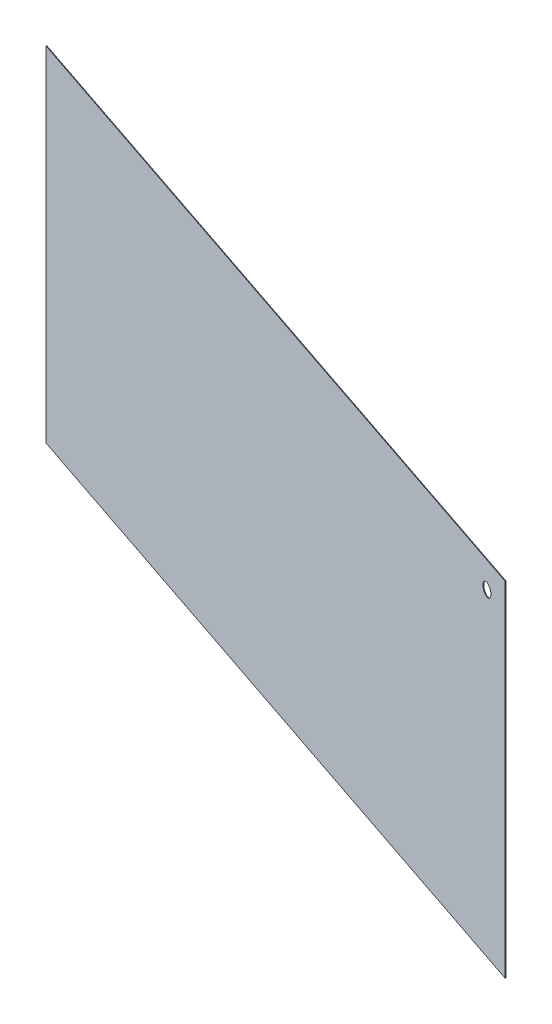
ISO-10303-21;
HEADER;
FILE_DESCRIPTION(('STEP AP214'),'2;1');
FILE_NAME('part.step','',(''),(''),'','','');
FILE_SCHEMA(('AUTOMOTIVE_DESIGN { 1 0 10303 214 1 1 1 1 }'));
ENDSEC;
DATA;
#1=APPLICATION_CONTEXT('core data for automotive mechanical design processes');
#2=APPLICATION_PROTOCOL_DEFINITION('international standard','automotive_design',2000,#1);
#3=PRODUCT_CONTEXT('',#1,'mechanical');
#4=PRODUCT('Part','Part','',(#3));
#5=PRODUCT_RELATED_PRODUCT_CATEGORY('part','',(#4));
#6=PRODUCT_DEFINITION_FORMATION('','',#4);
#7=PRODUCT_DEFINITION_CONTEXT('part definition',#1,'design');
#8=PRODUCT_DEFINITION('design','',#6,#7);
#9=PRODUCT_DEFINITION_SHAPE('','',#8);
#10=(LENGTH_UNIT() NAMED_UNIT(*) SI_UNIT(.MILLI.,.METRE.));
#11=(NAMED_UNIT(*) PLANE_ANGLE_UNIT() SI_UNIT($,.RADIAN.));
#12=(NAMED_UNIT(*) SI_UNIT($,.STERADIAN.) SOLID_ANGLE_UNIT());
#13=UNCERTAINTY_MEASURE_WITH_UNIT(LENGTH_MEASURE(1.E-05),#10,'distance_accuracy_value','');
#14=(GEOMETRIC_REPRESENTATION_CONTEXT(3) GLOBAL_UNCERTAINTY_ASSIGNED_CONTEXT((#13)) GLOBAL_UNIT_ASSIGNED_CONTEXT((#10,
#11,#12)) REPRESENTATION_CONTEXT('',''));
#15=CARTESIAN_POINT('',(0.,0.,0.));
#16=DIRECTION('',(0.,0.,1.));
#17=DIRECTION('',(1.,0.,0.));
#18=AXIS2_PLACEMENT_3D('',#15,#16,#17);
#19=CARTESIAN_POINT('',(-263.180218446603,546.5,779.785337524628));
#20=DIRECTION('',(-0.947491297113765,0.,-0.319781553398059));
#21=DIRECTION('',(0.,1.,0.));
#22=AXIS2_PLACEMENT_3D('',#19,#20,#21);
#23=PLANE('',#22);
#24=DIRECTION('',(0.319781553398059,0.,-0.947491297113765));
#25=VECTOR('',#24,1.);
#26=CARTESIAN_POINT('',(-263.180218446603,1093.,779.785337524628));
#27=LINE('',#26,#25);
#28=CARTESIAN_POINT('',(-263.500000000001,1093.,780.732828821742));
#29=VERTEX_POINT('',#28);
#30=CARTESIAN_POINT('',(-262.860436893205,1093.,778.837846227515));
#31=VERTEX_POINT('',#30);
#32=EDGE_CURVE('E11',#29,#31,#27,.T.);
#33=ORIENTED_EDGE('',*,*,#32,.F.);
#34=DIRECTION('',(0.,1.,0.));
#35=VECTOR('',#34,1.);
#36=CARTESIAN_POINT('',(-263.500000000001,546.5,780.732828821742));
#37=LINE('',#36,#35);
#38=CARTESIAN_POINT('',(-263.500000000001,0.,780.732828821742));
#39=VERTEX_POINT('',#38);
#40=EDGE_CURVE('E75',#29,#39,#37,.F.);
#41=ORIENTED_EDGE('',*,*,#40,.T.);
#42=DIRECTION('',(0.319781553398059,0.,-0.947491297113765));
#43=VECTOR('',#42,1.);
#44=CARTESIAN_POINT('',(-263.180218446603,0.,779.785337524628));
#45=LINE('',#44,#43);
#46=CARTESIAN_POINT('',(-262.860436893205,0.,778.837846227515));
#47=VERTEX_POINT('',#46);
#48=EDGE_CURVE('E47',#39,#47,#45,.T.);
#49=ORIENTED_EDGE('',*,*,#48,.T.);
#50=DIRECTION('',(0.,1.,0.));
#51=VECTOR('',#50,1.);
#52=CARTESIAN_POINT('',(-262.860436893205,546.5,778.837846227515));
#53=LINE('',#52,#51);
#54=EDGE_CURVE('E77',#31,#47,#53,.F.);
#55=ORIENTED_EDGE('',*,*,#54,.F.);
#56=EDGE_LOOP('',(#33,#41,#49,#55));
#57=FACE_BOUND('',#56,.T.);
#58=ADVANCED_FACE('F37',(#57),#23,.F.);
#59=CARTESIAN_POINT('',(-1363.52038558934,0.,408.416767716081));
#60=DIRECTION('',(0.,-1.,0.));
#61=DIRECTION('',(-0.947491297113765,0.,-0.319781553398059));
#62=AXIS2_PLACEMENT_3D('',#59,#60,#61);
#63=PLANE('',#62);
#64=ORIENTED_EDGE('',*,*,#48,.F.);
#65=DIRECTION('',(-0.947491297113765,0.,-0.319781553398059));
#66=VECTOR('',#65,1.);
#67=CARTESIAN_POINT('',(-1363.84016714274,0.,409.364259013195));
#68=LINE('',#67,#66);
#69=CARTESIAN_POINT('',(-2464.18033428547,0.,37.9956892046471));
#70=VERTEX_POINT('',#69);
#71=EDGE_CURVE('E89',#39,#70,#68,.T.);
#72=ORIENTED_EDGE('',*,*,#71,.T.);
#73=DIRECTION('',(0.319781553398059,0.,-0.947491297113765));
#74=VECTOR('',#73,1.);
#75=CARTESIAN_POINT('',(-2463.86055273208,0.,37.0481979075334));
#76=LINE('',#75,#74);
#77=CARTESIAN_POINT('',(-2463.54077117868,0.,36.1007066104197));
#78=VERTEX_POINT('',#77);
#79=EDGE_CURVE('E99',#70,#78,#76,.T.);
#80=ORIENTED_EDGE('',*,*,#79,.T.);
#81=DIRECTION('',(-0.947491297113765,0.,-0.319781553398059));
#82=VECTOR('',#81,1.);
#83=CARTESIAN_POINT('',(-1363.20060403594,0.,407.469276418968));
#84=LINE('',#83,#82);
#85=EDGE_CURVE('E94',#47,#78,#84,.T.);
#86=ORIENTED_EDGE('',*,*,#85,.F.);
#87=EDGE_LOOP('',(#64,#72,#80,#86));
#88=FACE_BOUND('',#87,.T.);
#89=ADVANCED_FACE('F107',(#88),#63,.T.);
#90=CARTESIAN_POINT('',(-2463.86055273208,546.5,37.0481979075334));
#91=DIRECTION('',(-0.947491297113765,0.,-0.319781553398059));
#92=DIRECTION('',(0.,1.,0.));
#93=AXIS2_PLACEMENT_3D('',#90,#91,#92);
#94=PLANE('',#93);
#95=ORIENTED_EDGE('',*,*,#79,.F.);
#96=DIRECTION('',(0.,1.,0.));
#97=VECTOR('',#96,1.);
#98=CARTESIAN_POINT('',(-2464.18033428547,546.5,37.9956892046471));
#99=LINE('',#98,#97);
#100=CARTESIAN_POINT('',(-2464.18033428547,1093.,37.9956892046471));
#101=VERTEX_POINT('',#100);
#102=EDGE_CURVE('E92',#70,#101,#99,.T.);
#103=ORIENTED_EDGE('',*,*,#102,.T.);
#104=DIRECTION('',(0.319781553398059,0.,-0.947491297113765));
#105=VECTOR('',#104,1.);
#106=CARTESIAN_POINT('',(-2463.86055273208,1093.,37.0481979075334));
#107=LINE('',#106,#105);
#108=CARTESIAN_POINT('',(-2463.54077117868,1093.,36.1007066104197));
#109=VERTEX_POINT('',#108);
#110=EDGE_CURVE('E41',#101,#109,#107,.T.);
#111=ORIENTED_EDGE('',*,*,#110,.T.);
#112=DIRECTION('',(0.,1.,0.));
#113=VECTOR('',#112,1.);
#114=CARTESIAN_POINT('',(-2463.54077117868,546.5,36.1007066104197));
#115=LINE('',#114,#113);
#116=EDGE_CURVE('E108',#78,#109,#115,.T.);
#117=ORIENTED_EDGE('',*,*,#116,.F.);
#118=EDGE_LOOP('',(#95,#103,#111,#117));
#119=FACE_BOUND('',#118,.T.);
#120=ADVANCED_FACE('F138',(#119),#94,.T.);
#121=CARTESIAN_POINT('',(-1363.52038558934,1093.,408.416767716081));
#122=DIRECTION('',(0.,-1.,0.));
#123=DIRECTION('',(-0.947491297113765,0.,-0.319781553398059));
#124=AXIS2_PLACEMENT_3D('',#121,#122,#123);
#125=PLANE('',#124);
#126=DIRECTION('',(-0.947491297113765,0.,-0.319781553398059));
#127=VECTOR('',#126,1.);
#128=CARTESIAN_POINT('',(-1363.84016714274,1093.,409.364259013195));
#129=LINE('',#128,#127);
#130=EDGE_CURVE('E87',#101,#29,#129,.F.);
#131=ORIENTED_EDGE('',*,*,#130,.T.);
#132=ORIENTED_EDGE('',*,*,#32,.T.);
#133=DIRECTION('',(-0.947491297113765,0.,-0.319781553398059));
#134=VECTOR('',#133,1.);
#135=CARTESIAN_POINT('',(-1363.20060403594,1093.,407.469276418968));
#136=LINE('',#135,#134);
#137=EDGE_CURVE('E106',#109,#31,#136,.F.);
#138=ORIENTED_EDGE('',*,*,#137,.F.);
#139=ORIENTED_EDGE('',*,*,#110,.F.);
#140=EDGE_LOOP('',(#131,#132,#138,#139));
#141=FACE_BOUND('',#140,.T.);
#142=ADVANCED_FACE('F39',(#141),#125,.F.);
#143=CARTESIAN_POINT('',(-1363.20060403594,546.5,407.469276418968));
#144=DIRECTION('',(0.319781553398059,0.,-0.947491297113765));
#145=DIRECTION('',(-0.947491297113765,0.,-0.319781553398059));
#146=AXIS2_PLACEMENT_3D('',#143,#144,#145);
#147=PLANE('',#146);
#148=CARTESIAN_POINT('',(-330.311935494597,1010.9999999752,756.072734751045));
#149=CARTESIAN_POINT('',(-330.311936914854,1010.32858473216,756.072734271703));
#150=CARTESIAN_POINT('',(-330.344453750806,1009.65710881628,756.061759728355));
#151=CARTESIAN_POINT('',(-330.47321967669,1008.32104249649,756.018300787962));
#152=CARTESIAN_POINT('',(-330.569466745073,1007.65645187487,755.985817073197));
#153=CARTESIAN_POINT('',(-330.803371922387,1006.44915122521,755.906873275848));
#154=CARTESIAN_POINT('',(-330.931609349786,1005.90438125312,755.863592705502));
#155=CARTESIAN_POINT('',(-331.230978963884,1004.82787909612,755.762554436836));
#156=CARTESIAN_POINT('',(-331.402120701275,1004.2961498431,755.704793515125));
#157=CARTESIAN_POINT('',(-331.690504221704,1003.51132225256,755.607463090647));
#158=CARTESIAN_POINT('',(-331.791991753933,1003.25166554249,755.573210701411));
#159=CARTESIAN_POINT('',(-332.005354456963,1002.73715003866,755.501200059392));
#160=CARTESIAN_POINT('',(-332.117229649767,1002.48229125506,755.463441799184));
#161=CARTESIAN_POINT('',(-332.467998668306,1001.72556949384,755.345056055722));
#162=CARTESIAN_POINT('',(-332.722080962038,1001.23143880417,755.259302412572));
#163=CARTESIAN_POINT('',(-333.268280000901,1000.26779922575,755.074958368839));
#164=CARTESIAN_POINT('',(-333.560366769904,999.798271336633,754.976378085301));
#165=CARTESIAN_POINT('',(-334.180667357163,998.886586959999,754.767024515541));
#166=CARTESIAN_POINT('',(-334.508880234727,998.444429760236,754.656251546805));
#167=CARTESIAN_POINT('',(-335.199295876775,997.590874558025,754.423233906245));
#168=CARTESIAN_POINT('',(-335.561491626211,997.179470238659,754.300991602024));
#169=CARTESIAN_POINT('',(-336.317718963862,996.390659604339,754.045762289108));
#170=CARTESIAN_POINT('',(-336.711750656816,996.013253401247,753.912775245064));
#171=CARTESIAN_POINT('',(-337.529191355135,995.293955899014,753.63688621356));
#172=CARTESIAN_POINT('',(-337.952655691174,994.952134682424,753.493965551808));
#173=CARTESIAN_POINT('',(-338.825152815771,994.307013767735,753.199494788131));
#174=CARTESIAN_POINT('',(-339.274186504647,994.003715427275,753.047944382344));
#175=CARTESIAN_POINT('',(-340.194823398483,993.437768869875,752.7372262819));
#176=CARTESIAN_POINT('',(-340.666428324887,993.175123759926,752.57805800625));
#177=CARTESIAN_POINT('',(-341.388187839003,992.813411874612,752.334461701664));
#178=CARTESIAN_POINT('',(-341.631186554462,992.698209214248,752.252448804089));
#179=CARTESIAN_POINT('',(-342.121611253601,992.478828480162,752.086928790773));
#180=CARTESIAN_POINT('',(-342.369037229893,992.37465038805,752.003421677525));
#181=CARTESIAN_POINT('',(-343.118352288048,992.078427124013,751.750525282581));
#182=CARTESIAN_POINT('',(-343.626303820428,991.903181175136,751.5790899031));
#183=CARTESIAN_POINT('',(-344.654318417709,991.598290162921,751.232131460488));
#184=CARTESIAN_POINT('',(-345.174382551565,991.468649140663,751.056608036582));
#185=CARTESIAN_POINT('',(-346.222967681262,991.255716641257,750.702706968924));
#186=CARTESIAN_POINT('',(-346.751488786709,991.17242576532,750.524329288181));
#187=CARTESIAN_POINT('',(-347.813320938359,991.052978116319,750.165957305307));
#188=CARTESIAN_POINT('',(-348.346631547519,991.016817085783,749.985963150679));
#189=CARTESIAN_POINT('',(-349.147727610479,990.998541139701,749.715590489511));
#190=CARTESIAN_POINT('',(-349.415238908461,990.998462939515,749.625304511496));
#191=CARTESIAN_POINT('',(-349.950021464134,991.010350509512,749.444813569887));
#192=CARTESIAN_POINT('',(-350.217292720598,991.022316340836,749.354608606705));
#193=CARTESIAN_POINT('',(-351.018042103613,991.076111489215,749.084352951204));
#194=CARTESIAN_POINT('',(-351.550536122554,991.13583668444,748.904634398569));
#195=CARTESIAN_POINT('',(-352.608808403197,991.302214190303,748.547463884335));
#196=CARTESIAN_POINT('',(-353.134586849952,991.408865204986,748.370011860281));
#197=CARTESIAN_POINT('',(-354.175817655346,991.66830683415,748.018592902229));
#198=CARTESIAN_POINT('',(-354.691270543258,991.821095077221,747.8446257896));
#199=CARTESIAN_POINT('',(-355.707675042454,992.171938335304,747.501585794801));
#200=CARTESIAN_POINT('',(-356.208638832379,992.369954010947,747.332508802299));
#201=CARTESIAN_POINT('',(-357.192724935431,992.810400713015,747.000376376734));
#202=CARTESIAN_POINT('',(-357.675847017681,993.05283231395,746.837321021594));
#203=CARTESIAN_POINT('',(-358.621004357371,993.579740165054,746.518327186809));
#204=CARTESIAN_POINT('',(-359.083040664444,993.864214319384,746.36238835291));
#205=CARTESIAN_POINT('',(-359.982903192987,994.473014144811,746.058681671805));
#206=CARTESIAN_POINT('',(-360.420728803851,994.797340820344,745.910914030681));
#207=CARTESIAN_POINT('',(-361.268388663728,995.483156182051,745.624825928795));
#208=CARTESIAN_POINT('',(-361.678267369724,995.84458344061,745.486490463649));
#209=CARTESIAN_POINT('',(-362.270134839253,996.413112902919,745.28673316837));
#210=CARTESIAN_POINT('',(-362.463613930761,996.607037927897,745.221433313247));
#211=CARTESIAN_POINT('',(-362.842546028141,997.00343444316,745.093542434353));
#212=CARTESIAN_POINT('',(-363.027999040195,997.205905926861,745.030951408496));
#213=CARTESIAN_POINT('',(-363.571855070587,997.82547957494,744.847398138135));
#214=CARTESIAN_POINT('',(-363.917858657167,998.254840504349,744.730620744258));
#215=CARTESIAN_POINT('',(-364.574469947678,999.142682581816,744.50901218796));
#216=CARTESIAN_POINT('',(-364.885074669636,999.601166178086,744.404182031964));
#217=CARTESIAN_POINT('',(-365.468290231676,1000.54314517272,744.207344785054));
#218=CARTESIAN_POINT('',(-365.740967382154,1001.02659483904,744.115315314154));
#219=CARTESIAN_POINT('',(-366.246871012223,1002.01599972025,743.944571108708));
#220=CARTESIAN_POINT('',(-366.480101206295,1002.52195281045,743.865855120512));
#221=CARTESIAN_POINT('',(-366.798648974087,1003.29509944378,743.75834415938));
#222=CARTESIAN_POINT('',(-366.899625020257,1003.5552149026,743.724264398439));
#223=CARTESIAN_POINT('',(-367.090993138598,1004.07974746996,743.659677003979));
#224=CARTESIAN_POINT('',(-367.181385150288,1004.34416460308,743.629169390873));
#225=CARTESIAN_POINT('',(-367.43656093377,1005.14312632134,743.543046691193));
#226=CARTESIAN_POINT('',(-367.585375815373,1005.68345748091,743.492821159673));
#227=CARTESIAN_POINT('',(-367.839362235874,1006.77444995707,743.407099874066));
#228=CARTESIAN_POINT('',(-367.944601582907,1007.32509381954,743.371581234502));
#229=CARTESIAN_POINT('',(-368.111076409654,1008.4337345434,743.315395411095));
#230=CARTESIAN_POINT('',(-368.17231437654,1008.99173098738,743.294727387824));
#231=CARTESIAN_POINT('',(-368.249980282771,1010.11122274802,743.268514878837));
#232=CARTESIAN_POINT('',(-368.266406496382,1010.67271819859,743.262970975562));
#233=CARTESIAN_POINT('',(-368.253841958607,1011.79514843021,743.267211550035));
#234=CARTESIAN_POINT('',(-368.224850418784,1012.35608320136,743.276996293882));
#235=CARTESIAN_POINT('',(-368.122342068772,1013.47315914447,743.311593212612));
#236=CARTESIAN_POINT('',(-368.048843283302,1014.0293021646,743.336399304089));
#237=CARTESIAN_POINT('',(-367.858072020486,1015.13315487918,743.400785257768));
#238=CARTESIAN_POINT('',(-367.740798508404,1015.68086437397,743.440365469196));
#239=CARTESIAN_POINT('',(-367.4631737607,1016.76409373725,743.534064771082));
#240=CARTESIAN_POINT('',(-367.302820773249,1017.29961310906,743.588184452788));
#241=CARTESIAN_POINT('',(-367.030608758296,1018.09058640085,743.680056938858));
#242=CARTESIAN_POINT('',(-366.934581652168,1018.35221454509,743.712466415609));
#243=CARTESIAN_POINT('',(-366.73204483708,1018.87091150775,743.780823283421));
#244=CARTESIAN_POINT('',(-366.625535132013,1019.12798032787,743.816770673167));
#245=CARTESIAN_POINT('',(-366.29037276805,1019.8923755525,743.929889117331));
#246=CARTESIAN_POINT('',(-366.046297913939,1020.39227816032,744.012265215381));
#247=CARTESIAN_POINT('',(-365.519317650663,1021.36870344374,744.190122856622));
#248=CARTESIAN_POINT('',(-365.236408921024,1021.84522411536,744.285605520483));
#249=CARTESIAN_POINT('',(-364.633848423613,1022.77165695787,744.488971749245));
#250=CARTESIAN_POINT('',(-364.314196039965,1023.22156868256,744.596855522005));
#251=CARTESIAN_POINT('',(-363.640219931535,1024.09151209694,744.824324763742));
#252=CARTESIAN_POINT('',(-363.285899351539,1024.51154649086,744.943909171342));
#253=CARTESIAN_POINT('',(-362.729629381144,1025.11705255872,745.131652188913));
#254=CARTESIAN_POINT('',(-362.539792106977,1025.31505619743,745.195722918228));
#255=CARTESIAN_POINT('',(-362.152301541663,1025.70235277082,745.326502309322));
#256=CARTESIAN_POINT('',(-361.954648202636,1025.89164565212,745.39321098726));
#257=CARTESIAN_POINT('',(-361.350566136034,1026.44605643638,745.597090750828));
#258=CARTESIAN_POINT('',(-360.932961017579,1026.79776555125,745.738033906605));
#259=CARTESIAN_POINT('',(-360.071390987632,1027.46296521493,746.028816738465));
#260=CARTESIAN_POINT('',(-359.627426554224,1027.77645645658,746.178656253193));
#261=CARTESIAN_POINT('',(-358.71612963644,1028.36313743499,746.486222079775));
#262=CARTESIAN_POINT('',(-358.248798454838,1028.63632941523,746.643947951938));
#263=CARTESIAN_POINT('',(-357.532688254424,1029.01421097845,746.885637593827));
#264=CARTESIAN_POINT('',(-357.291376131805,1029.13489155156,746.96708126055));
#265=CARTESIAN_POINT('',(-356.804107783401,1029.36531330131,747.131535994698));
#266=CARTESIAN_POINT('',(-356.558151585491,1029.47505454359,747.214547052715));
#267=CARTESIAN_POINT('',(-355.813978072626,1029.78751166753,747.465708158539));
#268=CARTESIAN_POINT('',(-355.309358510018,1029.97351232771,747.636018986826));
#269=CARTESIAN_POINT('',(-354.287192683887,1030.30005622189,747.98100344917));
#270=CARTESIAN_POINT('',(-353.769647036878,1030.44060161944,748.155676875152));
#271=CARTESIAN_POINT('',(-352.725222387707,1030.67552121704,748.508173766402));
#272=CARTESIAN_POINT('',(-352.198343198336,1030.76989448989,748.685997294854));
#273=CARTESIAN_POINT('',(-351.139037157363,1030.91166377105,749.043516706735));
#274=CARTESIAN_POINT('',(-350.606612120529,1030.9590746873,749.223211977673));
#275=CARTESIAN_POINT('',(-349.806697313099,1030.99439437152,749.49318596106));
#276=CARTESIAN_POINT('',(-349.539823427073,1031.00020045607,749.583256810359));
#277=CARTESIAN_POINT('',(-349.006084064532,1030.99978892837,749.763395670719));
#278=CARTESIAN_POINT('',(-348.739218588018,1030.99357131418,749.85346368178));
#279=CARTESIAN_POINT('',(-347.939398654019,1030.95702483959,750.123405645058));
#280=CARTESIAN_POINT('',(-347.407083834068,1030.90880832238,750.303063717422));
#281=CARTESIAN_POINT('',(-346.348189625776,1030.76546831599,750.660444134365));
#282=CARTESIAN_POINT('',(-345.821610708448,1030.6703410039,750.838166319975));
#283=CARTESIAN_POINT('',(-344.778056289505,1030.43399769355,751.190369505547));
#284=CARTESIAN_POINT('',(-344.261076475816,1030.29280294622,751.364851960848));
#285=CARTESIAN_POINT('',(-343.240212350491,1029.96510302615,751.709397094718));
#286=CARTESIAN_POINT('',(-342.736326836835,1029.77860202878,751.879460178973));
#287=CARTESIAN_POINT('',(-341.745431557376,1029.36096612761,752.213890724863));
#288=CARTESIAN_POINT('',(-341.258422029347,1029.12983059524,752.37825810625));
#289=CARTESIAN_POINT('',(-340.304577671316,1028.62502131357,752.700183839436));
#290=CARTESIAN_POINT('',(-339.83774454111,1028.35134398915,752.857741617549));
#291=CARTESIAN_POINT('',(-338.927659490929,1027.76388989303,753.16489843467));
#292=CARTESIAN_POINT('',(-338.484395717872,1027.45013355251,753.314501474134));
#293=CARTESIAN_POINT('',(-337.624276412182,1026.78452958717,753.604794681595));
#294=CARTESIAN_POINT('',(-337.207419271567,1026.43268428525,753.745485392293));
#295=CARTESIAN_POINT('',(-336.604430602748,1025.87812845161,753.948996130369));
#296=CARTESIAN_POINT('',(-336.407132105392,1025.68879176797,754.01558504803));
#297=CARTESIAN_POINT('',(-336.020347815739,1025.30142929274,754.146126068672));
#298=CARTESIAN_POINT('',(-335.830861981071,1025.10340354829,754.210078185955));
#299=CARTESIAN_POINT('',(-335.274668390379,1024.49681678733,754.397795425114));
#300=CARTESIAN_POINT('',(-334.920144624748,1024.07567275491,754.517448408561));
#301=CARTESIAN_POINT('',(-334.246206172645,1023.20383438314,754.744904941159));
#302=CARTESIAN_POINT('',(-333.926764015976,1022.75316361225,754.852717761595));
#303=CARTESIAN_POINT('',(-333.324705809482,1021.82519884021,755.055914465454));
#304=CARTESIAN_POINT('',(-333.042090245247,1021.34790448812,755.151298184989));
#305=CARTESIAN_POINT('',(-332.515661886658,1020.36969266521,755.32896955651));
#306=CARTESIAN_POINT('',(-332.271865405473,1019.86876537701,755.411251702746));
#307=CARTESIAN_POINT('',(-331.937084752719,1019.10249235315,755.524241318071));
#308=CARTESIAN_POINT('',(-331.830635570183,1018.84456439916,755.560168281256));
#309=CARTESIAN_POINT('',(-331.628282295374,1018.3241408478,755.628463203596));
#310=CARTESIAN_POINT('',(-331.532378269141,1018.06164522182,755.660831140462));
#311=CARTESIAN_POINT('',(-331.255572401371,1017.25330428245,755.75425406757));
#312=CARTESIAN_POINT('',(-331.091792511947,1016.70080696445,755.809530340412));
#313=CARTESIAN_POINT('',(-330.810010842772,1015.58295036819,755.904632617511));
#314=CARTESIAN_POINT('',(-330.692017097815,1015.01758885087,755.944455909998));
#315=CARTESIAN_POINT('',(-330.502727580607,1013.87892219863,756.008341769467));
#316=CARTESIAN_POINT('',(-330.431373656691,1013.30562786926,756.032423962833));
#317=CARTESIAN_POINT('',(-330.335986181952,1012.15490285112,756.064617561804));
#318=CARTESIAN_POINT('',(-330.311934273056,1011.57747385439,756.072735163319));
#319=CARTESIAN_POINT('',(-330.311935494597,1010.9999999752,756.072734751045));
#320=B_SPLINE_CURVE_WITH_KNOTS('',3,(#148,#149,#150,#151,#152,#153,#154,#155,#156,#157,#158,
#159,#160,#161,#162,#163,#164,#165,#166,#167,#168,#169,#170,#171,#172,#173,#174,#175,#176,#177,
#178,#179,#180,#181,#182,#183,#184,#185,#186,#187,#188,#189,#190,#191,#192,#193,#194,#195,#196,
#197,#198,#199,#200,#201,#202,#203,#204,#205,#206,#207,#208,#209,#210,#211,#212,#213,#214,#215,
#216,#217,#218,#219,#220,#221,#222,#223,#224,#225,#226,#227,#228,#229,#230,#231,#232,#233,#234,
#235,#236,#237,#238,#239,#240,#241,#242,#243,#244,#245,#246,#247,#248,#249,#250,#251,#252,#253,
#254,#255,#256,#257,#258,#259,#260,#261,#262,#263,#264,#265,#266,#267,#268,#269,#270,#271,#272,
#273,#274,#275,#276,#277,#278,#279,#280,#281,#282,#283,#284,#285,#286,#287,#288,#289,#290,#291,
#292,#293,#294,#295,#296,#297,#298,#299,#300,#301,#302,#303,#304,#305,#306,#307,#308,#309,#310,
#311,#312,#313,#314,#315,#316,#317,#318,#319),.UNSPECIFIED.,.T.,.F.,(4,2,2,2,2,2,2,2,2,2,2,2,2,
2,2,2,2,2,2,2,2,2,2,2,2,2,2,2,2,2,2,2,2,2,2,2,2,2,2,2,2,2,2,2,2,2,2,2,2,2,2,2,2,2,2,2,2,2,2,2,2,
2,2,2,2,2,2,2,2,2,2,2,2,2,2,2,2,2,2,2,2,2,2,2,2,4),(0.,2.01353392754215,4.02700398800874,
5.70914538511173,7.3916615674845,8.23408621753719,9.07651265200782,10.7609731667309,
12.4441130229366,14.1272090620188,15.8099584226797,17.4927133197477,19.1787219863943,
20.86479005557,22.5509869217711,23.3942214687044,24.237454608899,25.9273257053868,
27.6173465046876,29.3073892248208,30.9972792643988,31.8440641491425,32.6908533324075,
34.3841782869772,36.0774564797653,37.7706476544778,39.4623716421067,41.1541175133802,
42.8457790787993,44.537483289281,46.2264303833866,47.071043472443,47.9156559108657,
49.6044386550503,51.2933635559275,52.9792974886753,54.6650725787363,55.508152057336,
56.3512363533267,58.03715636585,59.720442958887,61.4036343969407,63.0868906550928,
64.7701761343411,66.4527803654573,68.1354243720325,69.8181368137388,70.6596336374375,
71.5011301487019,73.1860721910697,74.871158393548,76.5562728445546,78.2412345786325,
79.0860777400283,79.9309260776691,81.6203765508872,83.3097963915125,84.99912214608,
85.8443953424724,86.6896634672048,88.3798562884294,90.0699686488388,91.760114947637,
93.4497245468505,94.2946730184696,95.1396216269716,96.8290865612321,98.5186891983369,
100.207513520127,101.896182261028,103.584874784741,105.273709299078,106.961686302139,
108.649560420044,109.493664806829,110.337764615151,112.025629718171,113.712163592388,
115.398719702667,117.085982704197,117.929762159722,118.77354689912,120.507891576704,
122.242540468711,123.97502241168,125.706831839746),.UNSPECIFIED.);
#321=CARTESIAN_POINT('',(-368.261438941141,1011.,743.264647542446));
#322=VERTEX_POINT('',#321);
#323=EDGE_CURVE('E90',#322,#322,#320,.F.);
#324=ORIENTED_EDGE('',*,*,#323,.T.);
#325=EDGE_LOOP('',(#324));
#326=FACE_BOUND('',#325,.T.);
#327=ORIENTED_EDGE('',*,*,#116,.T.);
#328=ORIENTED_EDGE('',*,*,#137,.T.);
#329=ORIENTED_EDGE('',*,*,#54,.T.);
#330=ORIENTED_EDGE('',*,*,#85,.T.);
#331=EDGE_LOOP('',(#327,#328,#329,#330));
#332=FACE_BOUND('',#331,.T.);
#333=ADVANCED_FACE('F105',(#326,#332),#147,.T.);
#334=CARTESIAN_POINT('',(-1363.84016714274,546.5,409.364259013195));
#335=DIRECTION('',(0.319781553398059,0.,-0.947491297113765));
#336=DIRECTION('',(-0.947491297113765,0.,-0.319781553398059));
#337=AXIS2_PLACEMENT_3D('',#334,#335,#336);
#338=PLANE('',#337);
#339=CARTESIAN_POINT('',(-330.997562882926,1010.99999997766,757.952170492705));
#340=CARTESIAN_POINT('',(-330.997564262868,1011.67139432431,757.95217002697));
#341=CARTESIAN_POINT('',(-331.029989456607,1012.34284813996,757.941226413182));
#342=CARTESIAN_POINT('',(-331.158420269443,1013.67890383898,757.897880574589));
#343=CARTESIAN_POINT('',(-331.254423687248,1014.34350595877,757.865479092727));
#344=CARTESIAN_POINT('',(-331.487955469114,1015.55183495103,757.786661317619));
#345=CARTESIAN_POINT('',(-331.616156519799,1016.09759610339,757.743393024538));
#346=CARTESIAN_POINT('',(-331.9155324554,1017.17608130142,757.642352622343));
#347=CARTESIAN_POINT('',(-332.08671694527,1017.70880240397,757.584577271525));
#348=CARTESIAN_POINT('',(-332.375231948354,1018.49511037444,757.487202471201));
#349=CARTESIAN_POINT('',(-332.476774831967,1018.75526016142,757.452931400683));
#350=CARTESIAN_POINT('',(-332.6902686723,1019.27075859257,757.380876499377));
#351=CARTESIAN_POINT('',(-332.802219652818,1019.52610722576,757.343092660556));
#352=CARTESIAN_POINT('',(-333.153251745422,1020.28428979309,757.224618128697));
#353=CARTESIAN_POINT('',(-333.407557031998,1020.77938286593,757.1387892247));
#354=CARTESIAN_POINT('',(-333.954278679808,1021.74482117078,756.954268798659));
#355=CARTESIAN_POINT('',(-334.246659152215,1022.21518912936,756.855589389218));
#356=CARTESIAN_POINT('',(-334.867673008478,1023.12847506936,756.64599508873));
#357=CARTESIAN_POINT('',(-335.196305373562,1023.57139382163,756.535080541521));
#358=CARTESIAN_POINT('',(-335.887703495986,1024.42634450569,756.301731310474));
#359=CARTESIAN_POINT('',(-336.2504619511,1024.83838301143,756.179299091162));
#360=CARTESIAN_POINT('',(-337.007947334499,1025.62831369079,755.923645183503));
#361=CARTESIAN_POINT('',(-337.402674417311,1026.00620569934,755.790423443004));
#362=CARTESIAN_POINT('',(-338.220740759625,1026.72552363285,755.514323254512));
#363=CARTESIAN_POINT('',(-338.644073541601,1027.06695776851,755.371446992706));
#364=CARTESIAN_POINT('',(-339.516318084155,1027.71124852514,755.077061476332));
#365=CARTESIAN_POINT('',(-339.965230638936,1028.01410394738,754.925551953717));
#366=CARTESIAN_POINT('',(-340.885641006371,1028.57906911102,754.614910306708));
#367=CARTESIAN_POINT('',(-341.35714035206,1028.84117608156,754.455777664909));
#368=CARTESIAN_POINT('',(-342.078754435383,1029.201976673,754.212230443714));
#369=CARTESIAN_POINT('',(-342.321707002997,1029.31685826044,754.130233121195));
#370=CARTESIAN_POINT('',(-342.812041527304,1029.5355593073,753.964743542192));
#371=CARTESIAN_POINT('',(-343.059423477006,1029.63937878418,753.881251288069));
#372=CARTESIAN_POINT('',(-343.807416201705,1029.93401176181,753.628801185189));
#373=CARTESIAN_POINT('',(-344.314046165156,1030.10808588858,753.457811839741));
#374=CARTESIAN_POINT('',(-345.33934011078,1030.41070666476,753.11177162637));
#375=CARTESIAN_POINT('',(-345.858005143264,1030.53924932455,752.936720403961));
#376=CARTESIAN_POINT('',(-346.903715882454,1030.75004452416,752.583789452931));
#377=CARTESIAN_POINT('',(-347.430761637527,1030.83229679673,752.405909707985));
#378=CARTESIAN_POINT('',(-348.489570694147,1030.94971155997,752.048558030024));
#379=CARTESIAN_POINT('',(-349.021333551358,1030.98487843948,751.869086246973));
#380=CARTESIAN_POINT('',(-349.819661716361,1031.00167339526,751.599647760832));
#381=CARTESIAN_POINT('',(-350.085981696135,1031.00127248526,751.509763856787));
#382=CARTESIAN_POINT('',(-350.618363194014,1030.98847703562,751.330083280394));
#383=CARTESIAN_POINT('',(-350.884424710761,1030.97608243329,751.240286608505));
#384=CARTESIAN_POINT('',(-351.681520856368,1030.92107809508,750.971263933124));
#385=CARTESIAN_POINT('',(-352.211546401693,1030.86064944055,750.792378498776));
#386=CARTESIAN_POINT('',(-353.264832610249,1030.69308403767,750.436890800925));
#387=CARTESIAN_POINT('',(-353.788093479872,1030.58594871783,750.260288467764));
#388=CARTESIAN_POINT('',(-354.824260378709,1030.3257693699,749.910578595495));
#389=CARTESIAN_POINT('',(-355.337166952774,1030.17272776419,749.737470872498));
#390=CARTESIAN_POINT('',(-356.348402244606,1029.82164161953,749.396175502865));
#391=CARTESIAN_POINT('',(-356.846745126471,1029.62364256813,749.227983075796));
#392=CARTESIAN_POINT('',(-357.825612368617,1029.18349344933,748.897612033637));
#393=CARTESIAN_POINT('',(-358.30613650036,1028.94134281588,748.735433495679));
#394=CARTESIAN_POINT('',(-359.246159154038,1028.41527913711,748.418172634985));
#395=CARTESIAN_POINT('',(-359.705658680949,1028.13136809067,748.263089973066));
#396=CARTESIAN_POINT('',(-360.600550556177,1027.52399041859,747.961060904456));
#397=CARTESIAN_POINT('',(-361.035942250817,1027.20052272115,747.814114718382));
#398=CARTESIAN_POINT('',(-361.879405888927,1026.51631125411,747.529442855695));
#399=CARTESIAN_POINT('',(-362.287488793047,1026.15558258923,747.391713479824));
#400=CARTESIAN_POINT('',(-362.876757976614,1025.58827062062,747.192833114944));
#401=CARTESIAN_POINT('',(-363.069386710955,1025.3947798491,747.127820258273));
#402=CARTESIAN_POINT('',(-363.446654246158,1024.99930790043,747.000491174806));
#403=CARTESIAN_POINT('',(-363.631293055012,1024.79732673177,746.938174945314));
#404=CARTESIAN_POINT('',(-364.17276846478,1024.17930028544,746.755425142556));
#405=CARTESIAN_POINT('',(-364.51726312898,1023.75107660392,746.639157015143));
#406=CARTESIAN_POINT('',(-365.171055813958,1022.86571683436,746.418499747853));
#407=CARTESIAN_POINT('',(-365.480350822546,1022.40857827716,746.3141116246));
#408=CARTESIAN_POINT('',(-366.061859852653,1021.46841176117,746.117850338054));
#409=CARTESIAN_POINT('',(-366.334054922282,1020.9853707448,746.025983571089));
#410=CARTESIAN_POINT('',(-366.839111224363,1019.99686714732,745.855525341736));
#411=CARTESIAN_POINT('',(-367.071976041233,1019.49140661476,745.776932669595));
#412=CARTESIAN_POINT('',(-367.390096655749,1018.71905465026,745.669565874156));
#413=CARTESIAN_POINT('',(-367.490950898694,1018.45921205524,745.635527222219));
#414=CARTESIAN_POINT('',(-367.682112369235,1017.93524029596,745.571009572098));
#415=CARTESIAN_POINT('',(-367.772419540988,1017.67111110902,745.540530592762));
#416=CARTESIAN_POINT('',(-368.027399557299,1016.87303301841,745.454473965171));
#417=CARTESIAN_POINT('',(-368.176162194721,1016.33331747478,745.404266066241));
#418=CARTESIAN_POINT('',(-368.430508951532,1015.24233718072,745.318423165897));
#419=CARTESIAN_POINT('',(-368.536061798933,1014.69106436825,745.282798718886));
#420=CARTESIAN_POINT('',(-368.703153896276,1013.58114420525,745.226404564542));
#421=CARTESIAN_POINT('',(-368.764695464801,1013.02249724477,745.20563407468));
#422=CARTESIAN_POINT('',(-368.842977860948,1011.90167864129,745.179213498238));
#423=CARTESIAN_POINT('',(-368.859716683899,1011.3395068417,745.173564088241));
#424=CARTESIAN_POINT('',(-368.847788741429,1010.21569464934,745.177589809621));
#425=CARTESIAN_POINT('',(-368.819121215409,1009.65405426562,745.187265197702));
#426=CARTESIAN_POINT('',(-368.717191236266,1008.53488395891,745.221666914285));
#427=CARTESIAN_POINT('',(-368.643895100157,1007.97735746282,745.24640461091));
#428=CARTESIAN_POINT('',(-368.453403827769,1006.87072804638,745.310696066862));
#429=CARTESIAN_POINT('',(-368.33620763434,1006.32162532922,745.35025018298));
#430=CARTESIAN_POINT('',(-368.058600364506,1005.2356151277,745.443943586025));
#431=CARTESIAN_POINT('',(-367.89818750521,1004.69870814747,745.498083474684));
#432=CARTESIAN_POINT('',(-367.625775504633,1003.90567315086,745.590023456585));
#433=CARTESIAN_POINT('',(-367.529663299177,1003.64336085647,745.622461654651));
#434=CARTESIAN_POINT('',(-367.326920293752,1003.12330393479,745.690888112406));
#435=CARTESIAN_POINT('',(-367.220289496696,1002.86555930623,745.726876371113));
#436=CARTESIAN_POINT('',(-366.884822084837,1002.09940884931,745.840097769986));
#437=CARTESIAN_POINT('',(-366.640529448334,1001.59843245908,745.922547370338));
#438=CARTESIAN_POINT('',(-366.112985992739,1000.61991075388,746.100595090912));
#439=CARTESIAN_POINT('',(-365.829731889911,1000.1423674185,746.196194319406));
#440=CARTESIAN_POINT('',(-365.226334532083,999.213977923348,746.399842991421));
#441=CARTESIAN_POINT('',(-364.906190825905,998.763132090199,746.507892587216));
#442=CARTESIAN_POINT('',(-364.231069818459,997.891450359488,746.735748236286));
#443=CARTESIAN_POINT('',(-363.876095740111,997.470611691519,746.855553201816));
#444=CARTESIAN_POINT('',(-363.319053632088,996.864395689381,747.043556818476));
#445=CARTESIAN_POINT('',(-363.129174252115,996.666403946359,747.107641758645));
#446=CARTESIAN_POINT('',(-362.741592392382,996.279141907649,747.238451961917));
#447=CARTESIAN_POINT('',(-362.543889864292,996.089871665855,747.305177241332));
#448=CARTESIAN_POINT('',(-361.939645070161,995.535551467861,747.509111925998));
#449=CARTESIAN_POINT('',(-361.521911523156,995.183933271967,747.65009842685));
#450=CARTESIAN_POINT('',(-360.660040587819,994.519014837571,747.940982815308));
#451=CARTESIAN_POINT('',(-360.215903883768,994.205713606667,748.090880471968));
#452=CARTESIAN_POINT('',(-359.304212506991,993.619554229196,748.398579429809));
#453=CARTESIAN_POINT('',(-358.83665926159,993.34669362163,748.556380249264));
#454=CARTESIAN_POINT('',(-358.120705823077,992.969724511902,748.798016983475));
#455=CARTESIAN_POINT('',(-357.879799306544,992.84953138364,748.879323756756));
#456=CARTESIAN_POINT('',(-357.393351477292,992.620090877568,749.043501562884));
#457=CARTESIAN_POINT('',(-357.14781019297,992.510843432721,749.126372586146));
#458=CARTESIAN_POINT('',(-356.404900570317,992.199864535226,749.377107124701));
#459=CARTESIAN_POINT('',(-355.90115005678,992.014845741592,749.547124645954));
#460=CARTESIAN_POINT('',(-354.880782085392,991.690269054995,749.891502326173));
#461=CARTESIAN_POINT('',(-354.36416536981,991.550708545994,750.065862234621));
#462=CARTESIAN_POINT('',(-353.321658070543,991.317776987121,750.417712013721));
#463=CARTESIAN_POINT('',(-352.795767335598,991.224406691342,750.595201935423));
#464=CARTESIAN_POINT('',(-351.739541309089,991.084815116724,750.951681831888));
#465=CARTESIAN_POINT('',(-351.209218875308,991.038486889048,751.130667467105));
#466=CARTESIAN_POINT('',(-350.412516875426,991.004692550449,751.399557116956));
#467=CARTESIAN_POINT('',(-350.146723882053,990.999378502062,751.489263161288));
#468=CARTESIAN_POINT('',(-349.615165464382,991.000737600651,751.668665945295));
#469=CARTESIAN_POINT('',(-349.349400040102,991.007410755479,751.758362684964));
#470=CARTESIAN_POINT('',(-348.55291098691,991.045259996178,752.027180464579));
#471=CARTESIAN_POINT('',(-348.022853954156,991.094259967922,752.206076526041));
#472=CARTESIAN_POINT('',(-346.968532922926,991.238986309217,752.561913480084));
#473=CARTESIAN_POINT('',(-346.444269403366,991.334716512571,752.738854211028));
#474=CARTESIAN_POINT('',(-345.405779588931,991.571981716951,753.089348075257));
#475=CARTESIAN_POINT('',(-344.891541880229,991.713460963073,753.262905060746));
#476=CARTESIAN_POINT('',(-343.876166441108,992.041457810569,753.60559774425));
#477=CARTESIAN_POINT('',(-343.375027483636,992.2279711764,753.774733856398));
#478=CARTESIAN_POINT('',(-342.389601899635,992.645351603351,754.107318361364));
#479=CARTESIAN_POINT('',(-341.905315533981,992.876219350706,754.270766666135));
#480=CARTESIAN_POINT('',(-340.956856518097,993.380194336054,754.590874827928));
#481=CARTESIAN_POINT('',(-340.492685591548,993.653305184706,754.747534103202));
#482=CARTESIAN_POINT('',(-339.587408148666,994.239582886568,755.053068336416));
#483=CARTESIAN_POINT('',(-339.146310990055,994.552765816542,755.201940136094));
#484=CARTESIAN_POINT('',(-338.290423420991,995.216968221432,755.490805117971));
#485=CARTESIAN_POINT('',(-337.875631437198,995.567985430044,755.630798831178));
#486=CARTESIAN_POINT('',(-337.275627728722,996.121103210803,755.833302134929));
#487=CARTESIAN_POINT('',(-337.079305007277,996.309928383307,755.899561724882));
#488=CARTESIAN_POINT('',(-336.694428850764,996.696201189339,756.029458744064));
#489=CARTESIAN_POINT('',(-336.505875371985,996.893648774344,756.093096188045));
#490=CARTESIAN_POINT('',(-335.952409585306,997.498406552304,756.27989278402));
#491=CARTESIAN_POINT('',(-335.599612895315,997.918204609288,756.398962873532));
#492=CARTESIAN_POINT('',(-334.928170016197,998.788056887964,756.625577141712));
#493=CARTESIAN_POINT('',(-334.609571672053,999.23815210133,756.733105172535));
#494=CARTESIAN_POINT('',(-334.009085256246,1000.16484931798,756.935771391661));
#495=CARTESIAN_POINT('',(-333.727197767937,1000.6414517423,757.030909383081));
#496=CARTESIAN_POINT('',(-333.202064847166,1001.61816879639,757.208143539907));
#497=CARTESIAN_POINT('',(-332.958836238987,1002.11829354101,757.290234027062));
#498=CARTESIAN_POINT('',(-332.624752960766,1002.88328272784,757.402988276097));
#499=CARTESIAN_POINT('',(-332.518510498927,1003.1407693852,757.43884547034));
#500=CARTESIAN_POINT('',(-332.316517683968,1003.66028725957,757.507018736247));
#501=CARTESIAN_POINT('',(-332.220767400869,1003.92231850689,757.539334784279));
#502=CARTESIAN_POINT('',(-331.943572992617,1004.73148397708,757.632888845128));
#503=CARTESIAN_POINT('',(-331.779353491224,1005.28531317745,757.688313488514));
#504=CARTESIAN_POINT('',(-331.496834855517,1006.40587677044,757.783664494339));
#505=CARTESIAN_POINT('',(-331.378543924406,1006.97261344933,757.823588088169));
#506=CARTESIAN_POINT('',(-331.188790342532,1008.11405472443,757.887630571049));
#507=CARTESIAN_POINT('',(-331.11726954935,1008.68874851718,757.911769083364));
#508=CARTESIAN_POINT('',(-331.021664442441,1009.84228126191,757.944036133936));
#509=CARTESIAN_POINT('',(-330.99756169313,1010.42111851509,757.952170894265));
#510=CARTESIAN_POINT('',(-330.997562882926,1010.99999997766,757.952170492705));
#511=B_SPLINE_CURVE_WITH_KNOTS('',3,(#339,#340,#341,#342,#343,#344,#345,#346,#347,#348,#349,
#350,#351,#352,#353,#354,#355,#356,#357,#358,#359,#360,#361,#362,#363,#364,#365,#366,#367,#368,
#369,#370,#371,#372,#373,#374,#375,#376,#377,#378,#379,#380,#381,#382,#383,#384,#385,#386,#387,
#388,#389,#390,#391,#392,#393,#394,#395,#396,#397,#398,#399,#400,#401,#402,#403,#404,#405,#406,
#407,#408,#409,#410,#411,#412,#413,#414,#415,#416,#417,#418,#419,#420,#421,#422,#423,#424,#425,
#426,#427,#428,#429,#430,#431,#432,#433,#434,#435,#436,#437,#438,#439,#440,#441,#442,#443,#444,
#445,#446,#447,#448,#449,#450,#451,#452,#453,#454,#455,#456,#457,#458,#459,#460,#461,#462,#463,
#464,#465,#466,#467,#468,#469,#470,#471,#472,#473,#474,#475,#476,#477,#478,#479,#480,#481,#482,
#483,#484,#485,#486,#487,#488,#489,#490,#491,#492,#493,#494,#495,#496,#497,#498,#499,#500,#501,
#502,#503,#504,#505,#506,#507,#508,#509,#510),.UNSPECIFIED.,.T.,.F.,(4,2,2,2,2,2,2,2,2,2,2,2,2,
2,2,2,2,2,2,2,2,2,2,2,2,2,2,2,2,2,2,2,2,2,2,2,2,2,2,2,2,2,2,2,2,2,2,2,2,2,2,2,2,2,2,2,2,2,2,2,2,
2,2,2,2,2,2,2,2,2,2,2,2,2,2,2,2,2,2,2,2,2,2,2,2,4),(0.,2.01347277704844,4.02687584459715,
5.71187216452539,7.39724534440003,8.24110388069901,9.08496434648904,10.7722924574301,
12.458041488722,14.1437431581029,15.8290849416227,17.5144348721264,19.1994044397097,
20.8844263509755,22.5695627923255,23.4122682246208,24.2549723269357,25.9397789004806,
27.6247330658262,29.3096969588654,30.9945037848083,31.8375182664086,32.6805371532244,
34.3663245469638,36.0520603847195,37.7377072851109,39.4216562027534,41.1056267108324,
42.789516640745,44.4734522063878,46.1567078033959,46.9984737594939,47.8402388736327,
49.5233457126802,51.2065964744585,52.8907038999291,54.5746577590362,55.4168350348778,
56.2590167694712,57.9431321414954,59.6284642035647,61.3137074731929,62.999026146775,
64.6843730513253,66.3709935336075,68.0576546336587,69.7443853270477,70.5878925578992,
71.4313995551974,73.1195142304429,74.8077712700077,76.4960489599775,78.1841705775554,
79.0290829815653,79.8740006059772,81.563590902166,83.2531374290277,84.9425810969209,
85.7860675338784,86.6295488044931,88.3161713330701,90.0026967826165,91.6892497652297,
93.3719597730431,94.213457576307,95.0549559307696,96.737508495336,98.4201991216472,
100.100846713235,101.781336298304,103.461851885435,105.142511191366,106.823846898008,
108.505081947195,109.345870738666,110.18665479911,111.867891792508,113.551451067223,
115.23503709124,116.919353814792,117.761660052329,118.60397191071,120.342534686022,
122.081407839622,123.818115178268,125.554147171776),.UNSPECIFIED.);
#512=CARTESIAN_POINT('',(-368.854937766324,1011.,745.175176989268));
#513=VERTEX_POINT('',#512);
#514=EDGE_CURVE('E113',#513,#513,#511,.F.);
#515=ORIENTED_EDGE('',*,*,#514,.T.);
#516=EDGE_LOOP('',(#515));
#517=FACE_BOUND('',#516,.T.);
#518=ORIENTED_EDGE('',*,*,#102,.F.);
#519=ORIENTED_EDGE('',*,*,#71,.F.);
#520=ORIENTED_EDGE('',*,*,#40,.F.);
#521=ORIENTED_EDGE('',*,*,#130,.F.);
#522=EDGE_LOOP('',(#518,#519,#520,#521));
#523=FACE_BOUND('',#522,.T.);
#524=ADVANCED_FACE('F86',(#517,#523),#338,.F.);
#525=CARTESIAN_POINT('',(-368.261438941141,1011.,743.264647542446));
#526=CARTESIAN_POINT('',(-368.854937766324,1011.,745.175176989268));
#527=CARTESIAN_POINT('',(-368.261438945199,1008.38068488296,743.264647541077));
#528=CARTESIAN_POINT('',(-368.854937770531,1008.38395954222,745.175176987848));
#529=CARTESIAN_POINT('',(-367.766586313763,1005.76125796844,743.431661996688));
#530=CARTESIAN_POINT('',(-368.362679715608,1005.76780742655,745.341315765012));
#531=CARTESIAN_POINT('',(-365.863696133289,1000.92287231864,744.073893940888));
#532=CARTESIAN_POINT('',(-366.468093835835,1000.93282081045,745.980744979323));
#533=CARTESIAN_POINT('',(-364.455560986848,998.70367339301,744.549144368934));
#534=CARTESIAN_POINT('',(-365.065665832003,998.713747558765,746.454069227219));
#535=CARTESIAN_POINT('',(-360.942365123368,995.003125329895,745.734859988737));
#536=CARTESIAN_POINT('',(-361.563169563911,995.010904245237,747.636173696983));
#537=CARTESIAN_POINT('',(-358.837057159974,993.52151448827,746.445408626985));
#538=CARTESIAN_POINT('',(-359.462851563907,993.526875743327,748.34503820552));
#539=CARTESIAN_POINT('',(-354.250178866025,991.520003803256,747.993495739294));
#540=CARTESIAN_POINT('',(-354.883890058542,991.521474112504,749.890453374605));
#541=CARTESIAN_POINT('',(-349.286689356093,990.480018945084,749.668690425087));
#542=CARTESIAN_POINT('',(-349.926252458448,990.478548699343,751.563673020814));
#543=CARTESIAN_POINT('',(-344.323199611497,991.52000264153,751.343885190081));
#544=CARTESIAN_POINT('',(-344.968614622183,991.521472949015,753.236892746731));
#545=CARTESIAN_POINT('',(-339.736320867289,993.521512326493,752.891972454355));
#546=CARTESIAN_POINT('',(-340.389652667916,993.526873578439,754.782308067322));
#547=CARTESIAN_POINT('',(-337.631012688816,995.003122620721,753.602521165192));
#548=CARTESIAN_POINT('',(-338.289334452702,995.010901533788,755.491172648493));
#549=CARTESIAN_POINT('',(-334.117816117319,998.703669739902,754.788237023953));
#550=CARTESIAN_POINT('',(-334.786837476825,998.713743906184,756.673277357137));
#551=CARTESIAN_POINT('',(-332.709680504451,1000.92286827635,755.26348760942));
#552=CARTESIAN_POINT('',(-333.384409007012,1000.93281677069,757.146601762304));
#553=CARTESIAN_POINT('',(-330.80678892459,1005.76125432226,755.905720025918));
#554=CARTESIAN_POINT('',(-331.489821731665,1005.76780378697,757.786031447625));
#555=CARTESIAN_POINT('',(-329.817103602879,1010.99999827185,756.23974220693));
#556=CARTESIAN_POINT('',(-330.505325459075,1010.99999827708,758.118302306811));
#557=CARTESIAN_POINT('',(-330.806788092852,1016.23874240393,755.905720306632));
#558=CARTESIAN_POINT('',(-331.489820905204,1016.23219294691,757.786031726559));
#559=CARTESIAN_POINT('',(-332.709678911116,1021.07712877678,755.263488147176));
#560=CARTESIAN_POINT('',(-333.384407421357,1021.06718028551,757.146602297468));
#561=CARTESIAN_POINT('',(-334.117814130698,1023.2963275326,754.788237694444));
#562=CARTESIAN_POINT('',(-334.78683549897,1023.2862533677,756.67327802467));
#563=CARTESIAN_POINT('',(-337.631009706544,1026.99687490552,753.602522171718));
#564=CARTESIAN_POINT('',(-338.289331479754,1026.98909599199,755.491173651873));
#565=CARTESIAN_POINT('',(-339.736317196578,1028.47848538157,752.891973693232));
#566=CARTESIAN_POINT('',(-340.389649006537,1028.47312412785,754.78230930305));
#567=CARTESIAN_POINT('',(-344.323195213711,1030.47999613696,751.343886674349));
#568=CARTESIAN_POINT('',(-344.968610233801,1030.47852582807,753.236894227826));
#569=CARTESIAN_POINT('',(-349.286685291929,1031.51998116095,749.668691796757));
#570=CARTESIAN_POINT('',(-349.926248402346,1031.52145140638,751.563674389763));
#571=CARTESIAN_POINT('',(-354.250175562266,1030.47999718102,747.993496854324));
#572=CARTESIAN_POINT('',(-354.883886763518,1030.47852687362,749.890454486687));
#573=CARTESIAN_POINT('',(-358.837054413119,1028.47848716953,746.445409554058));
#574=CARTESIAN_POINT('',(-359.462848824135,1028.47312591787,748.345039130202));
#575=CARTESIAN_POINT('',(-360.942362537213,1026.99687673998,745.734860861573));
#576=CARTESIAN_POINT('',(-361.563166985151,1026.98909782724,747.636174567324));
#577=CARTESIAN_POINT('',(-364.455558994715,1023.29632933673,744.549145041285));
#578=CARTESIAN_POINT('',(-365.065663846584,1023.28625517093,746.454069897305));
#579=CARTESIAN_POINT('',(-365.863694531164,1021.07713063274,744.073894481611));
#580=CARTESIAN_POINT('',(-366.468092239331,1021.06718213904,745.980745518149));
#581=CARTESIAN_POINT('',(-367.766585886083,1016.23874423877,743.431662141032));
#582=CARTESIAN_POINT('',(-368.362679289491,1016.23219477752,745.341315908828));
#583=CARTESIAN_POINT('',(-368.261438937083,1013.61931620868,743.264647543816));
#584=CARTESIAN_POINT('',(-368.854937762118,1013.61604154805,745.175176990687));
#585=CARTESIAN_POINT('',(-368.261438941141,1011.,743.264647542446));
#586=CARTESIAN_POINT('',(-368.854937766324,1011.,745.175176989268));
#587=B_SPLINE_SURFACE_WITH_KNOTS('',3,1,((#525,#526),(#527,#528),(#529,#530),(#531,#532),(#533,
#534),(#535,#536),(#537,#538),(#539,#540),(#541,#542),(#543,#544),(#545,#546),(#547,#548),(#549,
#550),(#551,#552),(#553,#554),(#555,#556),(#557,#558),(#559,#560),(#561,#562),(#563,#564),(#565,
#566),(#567,#568),(#569,#570),(#571,#572),(#573,#574),(#575,#576),(#577,#578),(#579,#580),(#581,
#582),(#583,#584),(#585,#586)),.UNSPECIFIED.,.T.,.F.,.F.,(4,1,1,1,1,1,1,1,1,1,1,1,1,1,1,1,1,1,1,
1,1,1,1,1,1,1,1,1,4),(2,2),(0.,0.0624984373298048,0.0625011052345802,0.124997944065562,
0.125001714821974,0.187498646209711,0.187501312180438,0.249999981547035,0.312498654665819,
0.312501320516341,0.3749982496089,0.375002020257062,0.43749885830442,0.437501526080749,
0.499999986243241,0.562498448104527,0.562501115949708,0.624997952007664,0.625001723506111,
0.687498640521915,0.68750130646799,0.749999984503298,0.812498662469546,0.812501328334876,
0.874998258010106,0.875002028660835,0.937498868846713,0.937501536623084,1.),(0.,1.),.UNSPECIFIED.);
#588=CARTESIAN_POINT('',(-368.261438941141,1011.,743.264647542446));
#589=CARTESIAN_POINT('',(-368.26762122057,1011.,743.284548890851));
#590=CARTESIAN_POINT('',(-368.273803499999,1011.,743.304450239255));
#591=CARTESIAN_POINT('',(-368.286168058857,1011.,743.344252936064));
#592=CARTESIAN_POINT('',(-368.292350338286,1011.,743.364154284468));
#593=CARTESIAN_POINT('',(-368.304714897144,1011.,743.403956981277));
#594=CARTESIAN_POINT('',(-368.310897176573,1011.,743.423858329682));
#595=CARTESIAN_POINT('',(-368.323261735431,1011.,743.46366102649));
#596=CARTESIAN_POINT('',(-368.32944401486,1011.,743.483562374895));
#597=CARTESIAN_POINT('',(-368.341808573718,1011.,743.523365071703));
#598=CARTESIAN_POINT('',(-368.347990853147,1011.,743.543266420108));
#599=CARTESIAN_POINT('',(-368.360355412005,1011.,743.583069116917));
#600=CARTESIAN_POINT('',(-368.366537691434,1011.,743.602970465321));
#601=CARTESIAN_POINT('',(-368.378902250292,1011.,743.64277316213));
#602=CARTESIAN_POINT('',(-368.385084529721,1011.,743.662674510534));
#603=CARTESIAN_POINT('',(-368.397449088579,1011.,743.702477207343));
#604=CARTESIAN_POINT('',(-368.403631368008,1011.,743.722378555747));
#605=CARTESIAN_POINT('',(-368.415995926866,1011.,743.762181252556));
#606=CARTESIAN_POINT('',(-368.422178206295,1011.,743.782082600961));
#607=CARTESIAN_POINT('',(-368.434542765153,1011.,743.821885297769));
#608=CARTESIAN_POINT('',(-368.440725044582,1011.,743.841786646174));
#609=CARTESIAN_POINT('',(-368.45308960344,1011.,743.881589342982));
#610=CARTESIAN_POINT('',(-368.459271882869,1011.,743.901490691387));
#611=CARTESIAN_POINT('',(-368.471636441727,1011.,743.941293388196));
#612=CARTESIAN_POINT('',(-368.477818721156,1011.,743.9611947366));
#613=CARTESIAN_POINT('',(-368.490183280014,1011.,744.000997433409));
#614=CARTESIAN_POINT('',(-368.496365559443,1011.,744.020898781813));
#615=CARTESIAN_POINT('',(-368.508730118301,1011.,744.060701478622));
#616=CARTESIAN_POINT('',(-368.51491239773,1011.,744.080602827026));
#617=CARTESIAN_POINT('',(-368.527276956588,1011.,744.120405523835));
#618=CARTESIAN_POINT('',(-368.533459236017,1011.,744.140306872239));
#619=CARTESIAN_POINT('',(-368.545823794875,1011.,744.180109569048));
#620=CARTESIAN_POINT('',(-368.552006074304,1011.,744.200010917453));
#621=CARTESIAN_POINT('',(-368.564370633162,1011.,744.239813614261));
#622=CARTESIAN_POINT('',(-368.570552912591,1011.,744.259714962666));
#623=CARTESIAN_POINT('',(-368.582917471449,1011.,744.299517659475));
#624=CARTESIAN_POINT('',(-368.589099750878,1011.,744.319419007879));
#625=CARTESIAN_POINT('',(-368.601464309736,1011.,744.359221704688));
#626=CARTESIAN_POINT('',(-368.607646589165,1011.,744.379123053092));
#627=CARTESIAN_POINT('',(-368.620011148023,1011.,744.418925749901));
#628=CARTESIAN_POINT('',(-368.626193427452,1011.,744.438827098305));
#629=CARTESIAN_POINT('',(-368.63855798631,1011.,744.478629795114));
#630=CARTESIAN_POINT('',(-368.644740265739,1011.,744.498531143518));
#631=CARTESIAN_POINT('',(-368.657104824597,1011.,744.538333840327));
#632=CARTESIAN_POINT('',(-368.663287104026,1011.,744.558235188731));
#633=CARTESIAN_POINT('',(-368.675651662884,1011.,744.59803788554));
#634=CARTESIAN_POINT('',(-368.681833942313,1011.,744.617939233945));
#635=CARTESIAN_POINT('',(-368.694198501171,1011.,744.657741930754));
#636=CARTESIAN_POINT('',(-368.7003807806,1011.,744.677643279158));
#637=CARTESIAN_POINT('',(-368.712745339458,1011.,744.717445975967));
#638=CARTESIAN_POINT('',(-368.718927618887,1011.,744.737347324371));
#639=CARTESIAN_POINT('',(-368.731292177745,1011.,744.77715002118));
#640=CARTESIAN_POINT('',(-368.737474457174,1011.,744.797051369584));
#641=CARTESIAN_POINT('',(-368.749839016032,1011.,744.836854066393));
#642=CARTESIAN_POINT('',(-368.756021295461,1011.,744.856755414797));
#643=CARTESIAN_POINT('',(-368.768385854319,1011.,744.896558111606));
#644=CARTESIAN_POINT('',(-368.774568133748,1011.,744.916459460011));
#645=CARTESIAN_POINT('',(-368.786932692606,1011.,744.956262156819));
#646=CARTESIAN_POINT('',(-368.793114972034,1011.,744.976163505224));
#647=CARTESIAN_POINT('',(-368.805479530892,1011.,745.015966202032));
#648=CARTESIAN_POINT('',(-368.811661810321,1011.,745.035867550437));
#649=CARTESIAN_POINT('',(-368.824026369179,1011.,745.075670247246));
#650=CARTESIAN_POINT('',(-368.830208648609,1011.,745.09557159565));
#651=CARTESIAN_POINT('',(-368.842573207466,1011.,745.135374292459));
#652=CARTESIAN_POINT('',(-368.848755486895,1011.,745.155275640863));
#653=CARTESIAN_POINT('',(-368.854937766324,1011.,745.175176989268));
#654=B_SPLINE_CURVE_WITH_KNOTS('',3,(#588,#589,#590,#591,#592,#593,#594,#595,#596,#597,#598,
#599,#600,#601,#602,#603,#604,#605,#606,#607,#608,#609,#610,#611,#612,#613,#614,#615,#616,#617,
#618,#619,#620,#621,#622,#623,#624,#625,#626,#627,#628,#629,#630,#631,#632,#633,#634,#635,#636,
#637,#638,#639,#640,#641,#642,#643,#644,#645,#646,#647,#648,#649,#650,#651,#652,#653),
.UNSPECIFIED.,.F.,.F.,(4,2,2,2,2,2,2,2,2,2,2,2,2,2,2,2,2,2,2,2,2,2,2,2,2,2,2,2,2,2,2,2,4),(0.,
0.0625184630749772,0.125036926149971,0.187555389225071,0.250073852299942,0.312592315374952,
0.375110778449913,0.437629241524906,0.500147704599884,0.562666167674877,0.625184630749871,
0.687703093824865,0.750221556899859,0.812740019974852,0.875258483049846,0.937776946124717,
1.0002954091998,1.06281387227479,1.12533233534979,1.18785079842466,1.25036926149976,
1.31288772457465,1.37540618764973,1.43792465072462,1.50044311379972,1.56296157687459,
1.62548003994969,1.68799850302468,1.75051696609957,1.81303542917453,1.87555389224954,
1.93807235532464,2.0005908183996),.UNSPECIFIED.);
#655=EDGE_CURVE('',#322,#513,#654,.T.);
#656=ORIENTED_EDGE('',*,*,#323,.F.);
#657=ORIENTED_EDGE('',*,*,#514,.F.);
#658=ORIENTED_EDGE('',*,*,#655,.T.);
#659=ORIENTED_EDGE('',*,*,#655,.F.);
#660=EDGE_LOOP('',(#656,#658,#657,#659));
#661=FACE_BOUND('',#660,.T.);
#662=ADVANCED_FACE('F125',(#661),#587,.F.);
#663=CLOSED_SHELL('',(#58,#89,#120,#142,#333,#524,#662));
#664=MANIFOLD_SOLID_BREP('B2',#663);
#665=ADVANCED_BREP_SHAPE_REPRESENTATION('',(#18,#664),#14);
#666=SHAPE_DEFINITION_REPRESENTATION(#9,#665);
ENDSEC;
END-ISO-10303-21;
